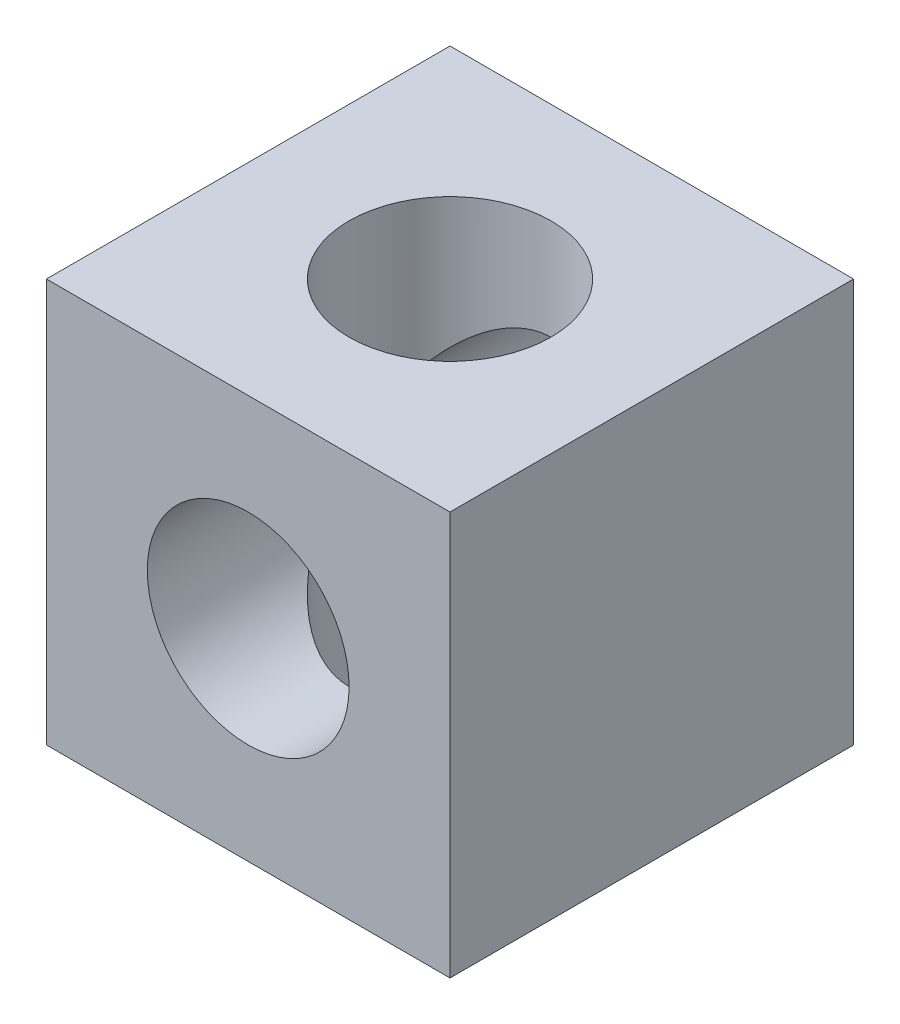
ISO-10303-21;
HEADER;
FILE_DESCRIPTION(('STEP AP214'),'2;1');
FILE_NAME('part.step','',(''),(''),'','','');
FILE_SCHEMA(('AUTOMOTIVE_DESIGN { 1 0 10303 214 1 1 1 1 }'));
ENDSEC;
DATA;
#1=APPLICATION_CONTEXT('core data for automotive mechanical design processes');
#2=APPLICATION_PROTOCOL_DEFINITION('international standard','automotive_design',2000,#1);
#3=PRODUCT_CONTEXT('',#1,'mechanical');
#4=PRODUCT('Part','Part','',(#3));
#5=PRODUCT_RELATED_PRODUCT_CATEGORY('part','',(#4));
#6=PRODUCT_DEFINITION_FORMATION('','',#4);
#7=PRODUCT_DEFINITION_CONTEXT('part definition',#1,'design');
#8=PRODUCT_DEFINITION('design','',#6,#7);
#9=PRODUCT_DEFINITION_SHAPE('','',#8);
#10=(LENGTH_UNIT() NAMED_UNIT(*) SI_UNIT(.MILLI.,.METRE.));
#11=(NAMED_UNIT(*) PLANE_ANGLE_UNIT() SI_UNIT($,.RADIAN.));
#12=(NAMED_UNIT(*) SI_UNIT($,.STERADIAN.) SOLID_ANGLE_UNIT());
#13=UNCERTAINTY_MEASURE_WITH_UNIT(LENGTH_MEASURE(1.E-05),#10,'distance_accuracy_value','');
#14=(GEOMETRIC_REPRESENTATION_CONTEXT(3) GLOBAL_UNCERTAINTY_ASSIGNED_CONTEXT((#13)) GLOBAL_UNIT_ASSIGNED_CONTEXT((#10,
#11,#12)) REPRESENTATION_CONTEXT('',''));
#15=CARTESIAN_POINT('',(0.,0.,0.));
#16=DIRECTION('',(0.,0.,1.));
#17=DIRECTION('',(1.,0.,0.));
#18=AXIS2_PLACEMENT_3D('',#15,#16,#17);
#19=CARTESIAN_POINT('',(-3.53883589099269E-13,0.,10.0000000000002));
#20=DIRECTION('',(0.,0.,-1.));
#21=DIRECTION('',(-1.,0.,0.));
#22=AXIS2_PLACEMENT_3D('',#19,#20,#21);
#23=CYLINDRICAL_SURFACE('',#22,2.5);
#24=CARTESIAN_POINT('',(-2.28983498828939E-13,2.75333141702694E-13,5.00000000000008));
#25=DIRECTION('',(0.,0.707106781186552,-0.707106781186552));
#26=DIRECTION('',(0.,-0.707106781186553,-0.707106781186556));
#27=AXIS2_PLACEMENT_3D('',#24,#25,#26);
#28=ELLIPSE('',#27,3.53553390593274,2.5);
#29=CARTESIAN_POINT('',(2.5,6.65971184449221E-13,5.00000000000002));
#30=VERTEX_POINT('',#29);
#31=CARTESIAN_POINT('',(-2.49999999999995,5.04099800097135E-13,5.00000000000025));
#32=VERTEX_POINT('',#31);
#33=EDGE_CURVE('E11',#30,#32,#28,.F.);
#34=ORIENTED_EDGE('',*,*,#33,.F.);
#35=CARTESIAN_POINT('',(-2.28983498828939E-13,2.75333141702694E-13,5.00000000000008));
#36=DIRECTION('',(0.,-0.707106781186553,-0.707106781186556));
#37=DIRECTION('',(0.,0.707106781186552,-0.707106781186552));
#38=AXIS2_PLACEMENT_3D('',#35,#36,#37);
#39=ELLIPSE('',#38,3.53553390593274,2.5);
#40=EDGE_CURVE('E30',#32,#30,#39,.F.);
#41=ORIENTED_EDGE('',*,*,#40,.F.);
#42=EDGE_LOOP('',(#34,#41));
#43=FACE_BOUND('',#42,.T.);
#44=CARTESIAN_POINT('',(-3.53883589099269E-13,0.,10.0000000000002));
#45=DIRECTION('',(0.,0.,1.));
#46=DIRECTION('',(1.,0.,0.));
#47=AXIS2_PLACEMENT_3D('',#44,#45,#46);
#48=CIRCLE('',#47,2.5);
#49=CARTESIAN_POINT('',(2.49999999999965,0.,10.0000000000002));
#50=VERTEX_POINT('',#49);
#51=EDGE_CURVE('E106',#50,#50,#48,.T.);
#52=ORIENTED_EDGE('',*,*,#51,.T.);
#53=EDGE_LOOP('',(#52));
#54=FACE_BOUND('',#53,.T.);
#55=ADVANCED_FACE('F16',(#43,#54),#23,.F.);
#56=CARTESIAN_POINT('',(-5.00000000000025,-4.99999999999999,10.0000000000003));
#57=DIRECTION('',(0.,0.,-1.));
#58=DIRECTION('',(-1.,0.,0.));
#59=AXIS2_PLACEMENT_3D('',#56,#57,#58);
#60=PLANE('',#59);
#61=DIRECTION('',(0.,-1.,0.));
#62=VECTOR('',#61,1.);
#63=CARTESIAN_POINT('',(-5.00000000000025,-4.99999999999999,10.0000000000003));
#64=LINE('',#63,#62);
#65=CARTESIAN_POINT('',(-5.00000000000077,5.00000000000037,10.));
#66=VERTEX_POINT('',#65);
#67=CARTESIAN_POINT('',(-5.00000000000025,-4.99999999999999,10.0000000000003));
#68=VERTEX_POINT('',#67);
#69=EDGE_CURVE('E95',#66,#68,#64,.T.);
#70=ORIENTED_EDGE('',*,*,#69,.T.);
#71=DIRECTION('',(1.,0.,0.));
#72=VECTOR('',#71,1.);
#73=CARTESIAN_POINT('',(-5.00000000000025,-4.99999999999999,10.0000000000003));
#74=LINE('',#73,#72);
#75=CARTESIAN_POINT('',(5.00000000000128,-4.99999999999928,10.));
#76=VERTEX_POINT('',#75);
#77=EDGE_CURVE('E93',#68,#76,#74,.T.);
#78=ORIENTED_EDGE('',*,*,#77,.T.);
#79=DIRECTION('',(0.,1.,0.));
#80=VECTOR('',#79,1.);
#81=CARTESIAN_POINT('',(5.00000000000128,-4.99999999999928,10.));
#82=LINE('',#81,#80);
#83=CARTESIAN_POINT('',(4.99999999999923,5.00000000000067,10.0000000000001));
#84=VERTEX_POINT('',#83);
#85=EDGE_CURVE('E91',#76,#84,#82,.T.);
#86=ORIENTED_EDGE('',*,*,#85,.T.);
#87=DIRECTION('',(-1.,0.,0.));
#88=VECTOR('',#87,1.);
#89=CARTESIAN_POINT('',(-5.00000000000077,5.00000000000037,10.));
#90=LINE('',#89,#88);
#91=EDGE_CURVE('E38',#84,#66,#90,.T.);
#92=ORIENTED_EDGE('',*,*,#91,.T.);
#93=EDGE_LOOP('',(#70,#78,#86,#92));
#94=FACE_BOUND('',#93,.T.);
#95=ORIENTED_EDGE('',*,*,#51,.F.);
#96=EDGE_LOOP('',(#95));
#97=FACE_BOUND('',#96,.T.);
#98=ADVANCED_FACE('F138',(#94,#97),#60,.F.);
#99=CARTESIAN_POINT('',(-5.00000000000046,-4.99999999999947,0.));
#100=DIRECTION('',(0.,0.,-1.));
#101=DIRECTION('',(-1.,0.,0.));
#102=AXIS2_PLACEMENT_3D('',#99,#100,#101);
#103=PLANE('',#102);
#104=DIRECTION('',(0.,-1.,0.));
#105=VECTOR('',#104,1.);
#106=CARTESIAN_POINT('',(-5.00000000000046,-4.99999999999947,0.));
#107=LINE('',#106,#105);
#108=CARTESIAN_POINT('',(-4.99999999999936,5.00000000000134,0.));
#109=VERTEX_POINT('',#108);
#110=CARTESIAN_POINT('',(-5.00000000000046,-4.99999999999947,0.));
#111=VERTEX_POINT('',#110);
#112=EDGE_CURVE('E103',#109,#111,#107,.T.);
#113=ORIENTED_EDGE('',*,*,#112,.F.);
#114=DIRECTION('',(-1.,0.,0.));
#115=VECTOR('',#114,1.);
#116=CARTESIAN_POINT('',(-4.99999999999936,5.00000000000134,0.));
#117=LINE('',#116,#115);
#118=CARTESIAN_POINT('',(4.99999999999944,5.00000000000012,0.));
#119=VERTEX_POINT('',#118);
#120=EDGE_CURVE('E97',#119,#109,#117,.T.);
#121=ORIENTED_EDGE('',*,*,#120,.F.);
#122=DIRECTION('',(0.,1.,0.));
#123=VECTOR('',#122,1.);
#124=CARTESIAN_POINT('',(4.99999999999998,-5.,-1.66533453693773E-13));
#125=LINE('',#124,#123);
#126=CARTESIAN_POINT('',(4.99999999999998,-5.,-1.66533453693773E-13));
#127=VERTEX_POINT('',#126);
#128=EDGE_CURVE('E99',#127,#119,#125,.T.);
#129=ORIENTED_EDGE('',*,*,#128,.F.);
#130=DIRECTION('',(1.,0.,0.));
#131=VECTOR('',#130,1.);
#132=CARTESIAN_POINT('',(-5.00000000000046,-4.99999999999947,0.));
#133=LINE('',#132,#131);
#134=EDGE_CURVE('E101',#111,#127,#133,.T.);
#135=ORIENTED_EDGE('',*,*,#134,.F.);
#136=EDGE_LOOP('',(#113,#121,#129,#135));
#137=FACE_BOUND('',#136,.T.);
#138=CARTESIAN_POINT('',(-2.42861286636753E-13,1.9412639898353E-13,1.38777878078145E-13));
#139=DIRECTION('',(0.,0.,1.));
#140=DIRECTION('',(1.,0.,0.));
#141=AXIS2_PLACEMENT_3D('',#138,#139,#140);
#142=CIRCLE('',#141,2.5);
#143=CARTESIAN_POINT('',(2.49999999999976,1.95629103194594E-13,1.37251321419285E-13));
#144=VERTEX_POINT('',#143);
#145=EDGE_CURVE('E109',#144,#144,#142,.T.);
#146=ORIENTED_EDGE('',*,*,#145,.T.);
#147=EDGE_LOOP('',(#146));
#148=FACE_BOUND('',#147,.T.);
#149=ADVANCED_FACE('F132',(#137,#148),#103,.T.);
#150=CARTESIAN_POINT('',(-5.00000000000025,-4.99999999999999,10.0000000000003));
#151=DIRECTION('',(1.,0.,0.));
#152=DIRECTION('',(0.,0.,-1.));
#153=AXIS2_PLACEMENT_3D('',#150,#151,#152);
#154=PLANE('',#153);
#155=ORIENTED_EDGE('',*,*,#112,.T.);
#156=DIRECTION('',(0.,0.,-1.));
#157=VECTOR('',#156,1.);
#158=CARTESIAN_POINT('',(-5.00000000000025,-4.99999999999999,10.0000000000003));
#159=LINE('',#158,#157);
#160=EDGE_CURVE('E73',#68,#111,#159,.T.);
#161=ORIENTED_EDGE('',*,*,#160,.F.);
#162=ORIENTED_EDGE('',*,*,#69,.F.);
#163=DIRECTION('',(0.,0.,-1.));
#164=VECTOR('',#163,1.);
#165=CARTESIAN_POINT('',(-5.00000000000077,5.00000000000037,10.));
#166=LINE('',#165,#164);
#167=EDGE_CURVE('E87',#66,#109,#166,.T.);
#168=ORIENTED_EDGE('',*,*,#167,.T.);
#169=EDGE_LOOP('',(#155,#161,#162,#168));
#170=FACE_BOUND('',#169,.T.);
#171=ADVANCED_FACE('F18',(#170),#154,.F.);
#172=CARTESIAN_POINT('',(-5.00000000000025,-4.99999999999999,10.0000000000003));
#173=DIRECTION('',(0.,1.,0.));
#174=DIRECTION('',(0.,0.,1.));
#175=AXIS2_PLACEMENT_3D('',#172,#173,#174);
#176=PLANE('',#175);
#177=CARTESIAN_POINT('',(7.63278329429795E-13,-4.99999999999972,5.00000000000023));
#178=DIRECTION('',(0.,1.,0.));
#179=DIRECTION('',(0.,0.,1.));
#180=AXIS2_PLACEMENT_3D('',#177,#178,#179);
#181=CIRCLE('',#180,2.5);
#182=CARTESIAN_POINT('',(7.6064154974631E-13,-4.99999999999972,7.50000000000023));
#183=VERTEX_POINT('',#182);
#184=EDGE_CURVE('E112',#183,#183,#181,.T.);
#185=ORIENTED_EDGE('',*,*,#184,.T.);
#186=EDGE_LOOP('',(#185));
#187=FACE_BOUND('',#186,.T.);
#188=ORIENTED_EDGE('',*,*,#134,.T.);
#189=DIRECTION('',(0.,0.,-1.));
#190=VECTOR('',#189,1.);
#191=CARTESIAN_POINT('',(5.00000000000128,-4.99999999999928,10.));
#192=LINE('',#191,#190);
#193=EDGE_CURVE('E81',#76,#127,#192,.T.);
#194=ORIENTED_EDGE('',*,*,#193,.F.);
#195=ORIENTED_EDGE('',*,*,#77,.F.);
#196=ORIENTED_EDGE('',*,*,#160,.T.);
#197=EDGE_LOOP('',(#188,#194,#195,#196));
#198=FACE_BOUND('',#197,.T.);
#199=ADVANCED_FACE('F136',(#187,#198),#176,.F.);
#200=CARTESIAN_POINT('',(5.00000000000128,-4.99999999999928,10.));
#201=DIRECTION('',(-1.,0.,0.));
#202=DIRECTION('',(0.,0.,1.));
#203=AXIS2_PLACEMENT_3D('',#200,#201,#202);
#204=PLANE('',#203);
#205=ORIENTED_EDGE('',*,*,#128,.T.);
#206=DIRECTION('',(0.,0.,-1.));
#207=VECTOR('',#206,1.);
#208=CARTESIAN_POINT('',(4.99999999999923,5.00000000000067,10.0000000000001));
#209=LINE('',#208,#207);
#210=EDGE_CURVE('E84',#84,#119,#209,.T.);
#211=ORIENTED_EDGE('',*,*,#210,.F.);
#212=ORIENTED_EDGE('',*,*,#85,.F.);
#213=ORIENTED_EDGE('',*,*,#193,.T.);
#214=EDGE_LOOP('',(#205,#211,#212,#213));
#215=FACE_BOUND('',#214,.T.);
#216=ADVANCED_FACE('F122',(#215),#204,.F.);
#217=CARTESIAN_POINT('',(-5.00000000000077,5.00000000000037,10.));
#218=DIRECTION('',(0.,-1.,0.));
#219=DIRECTION('',(1.,0.,0.));
#220=AXIS2_PLACEMENT_3D('',#217,#218,#219);
#221=PLANE('',#220);
#222=CARTESIAN_POINT('',(1.73472347597681E-13,5.00000000000033,5.0000000000001));
#223=DIRECTION('',(0.,1.,0.));
#224=DIRECTION('',(0.,0.,1.));
#225=AXIS2_PLACEMENT_3D('',#222,#223,#224);
#226=CIRCLE('',#225,2.5);
#227=CARTESIAN_POINT('',(1.70835567914196E-13,5.00000000000033,7.5000000000001));
#228=VERTEX_POINT('',#227);
#229=EDGE_CURVE('E115',#228,#228,#226,.T.);
#230=ORIENTED_EDGE('',*,*,#229,.F.);
#231=EDGE_LOOP('',(#230));
#232=FACE_BOUND('',#231,.T.);
#233=ORIENTED_EDGE('',*,*,#120,.T.);
#234=ORIENTED_EDGE('',*,*,#167,.F.);
#235=ORIENTED_EDGE('',*,*,#91,.F.);
#236=ORIENTED_EDGE('',*,*,#210,.T.);
#237=EDGE_LOOP('',(#233,#234,#235,#236));
#238=FACE_BOUND('',#237,.T.);
#239=ADVANCED_FACE('F119',(#232,#238),#221,.F.);
#240=CARTESIAN_POINT('',(-2.28983498828939E-13,2.75333141702694E-13,5.00000000000008));
#241=DIRECTION('',(0.,0.707106781186552,-0.707106781186552));
#242=DIRECTION('',(0.,-0.707106781186553,-0.707106781186556));
#243=AXIS2_PLACEMENT_3D('',#240,#241,#242);
#244=ELLIPSE('',#243,3.53553390593274,2.5);
#245=EDGE_CURVE('E24',#30,#32,#244,.T.);
#246=ORIENTED_EDGE('',*,*,#245,.F.);
#247=CARTESIAN_POINT('',(-2.28983498828939E-13,2.75333141702694E-13,5.00000000000008));
#248=DIRECTION('',(0.,-0.707106781186553,-0.707106781186556));
#249=DIRECTION('',(0.,0.707106781186552,-0.707106781186552));
#250=AXIS2_PLACEMENT_3D('',#247,#248,#249);
#251=ELLIPSE('',#250,3.53553390593274,2.5);
#252=EDGE_CURVE('E64',#32,#30,#251,.T.);
#253=ORIENTED_EDGE('',*,*,#252,.F.);
#254=EDGE_LOOP('',(#246,#253));
#255=FACE_BOUND('',#254,.T.);
#256=ORIENTED_EDGE('',*,*,#145,.F.);
#257=EDGE_LOOP('',(#256));
#258=FACE_BOUND('',#257,.T.);
#259=ADVANCED_FACE('F76',(#255,#258),#23,.F.);
#260=CARTESIAN_POINT('',(7.63278329429795E-13,-4.99999999999972,5.00000000000023));
#261=DIRECTION('',(0.,1.,0.));
#262=DIRECTION('',(0.,0.,1.));
#263=AXIS2_PLACEMENT_3D('',#260,#261,#262);
#264=CYLINDRICAL_SURFACE('',#263,2.5);
#265=ORIENTED_EDGE('',*,*,#245,.T.);
#266=ORIENTED_EDGE('',*,*,#40,.T.);
#267=EDGE_LOOP('',(#265,#266));
#268=FACE_BOUND('',#267,.T.);
#269=ORIENTED_EDGE('',*,*,#184,.F.);
#270=EDGE_LOOP('',(#269));
#271=FACE_BOUND('',#270,.T.);
#272=ADVANCED_FACE('F71',(#268,#271),#264,.F.);
#273=ORIENTED_EDGE('',*,*,#33,.T.);
#274=ORIENTED_EDGE('',*,*,#252,.T.);
#275=EDGE_LOOP('',(#273,#274));
#276=FACE_BOUND('',#275,.T.);
#277=ORIENTED_EDGE('',*,*,#229,.T.);
#278=EDGE_LOOP('',(#277));
#279=FACE_BOUND('',#278,.T.);
#280=ADVANCED_FACE('F65',(#276,#279),#264,.F.);
#281=CLOSED_SHELL('',(#55,#98,#149,#171,#199,#216,#239,#259,#272,#280));
#282=MANIFOLD_SOLID_BREP('B1',#281);
#283=ADVANCED_BREP_SHAPE_REPRESENTATION('',(#18,#282),#14);
#284=SHAPE_DEFINITION_REPRESENTATION(#9,#283);
ENDSEC;
END-ISO-10303-21;
